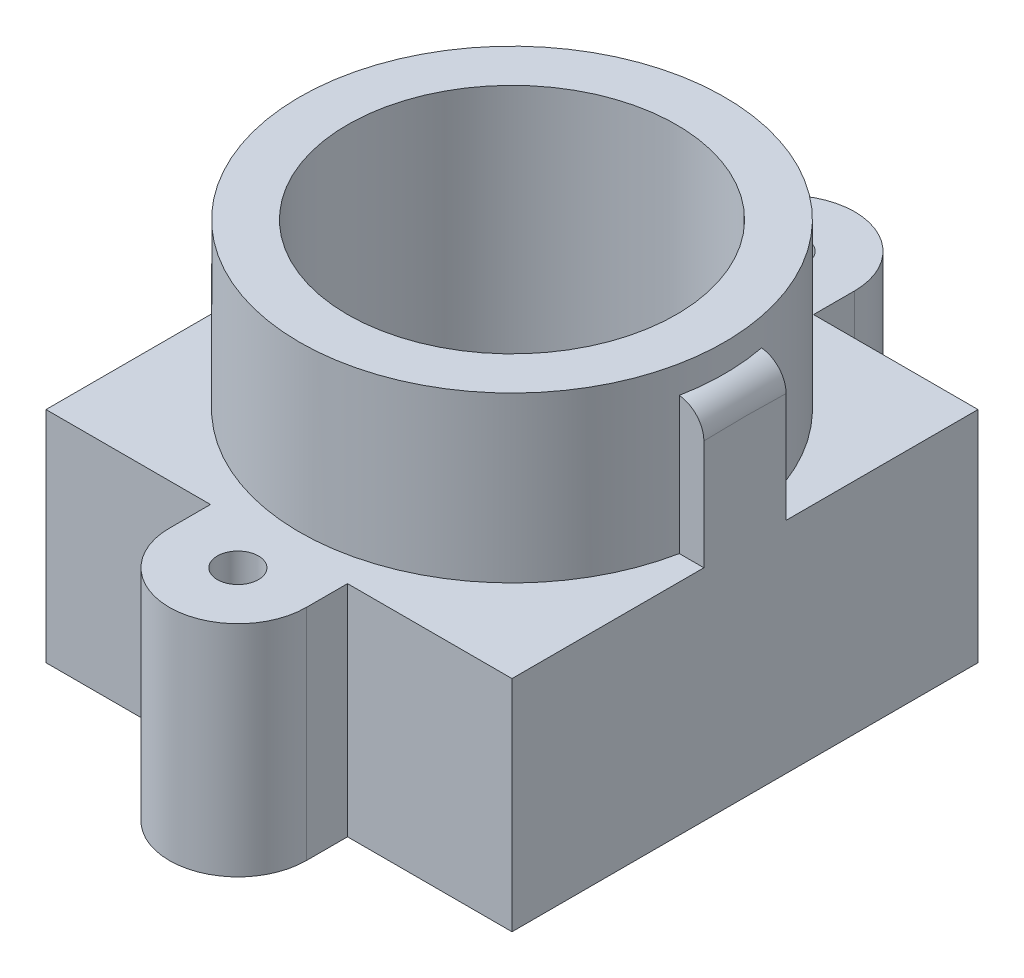
ISO-10303-21;
HEADER;
FILE_DESCRIPTION(('STEP AP214'),'2;1');
FILE_NAME('part.step','',(''),(''),'','','');
FILE_SCHEMA(('AUTOMOTIVE_DESIGN { 1 0 10303 214 1 1 1 1 }'));
ENDSEC;
DATA;
#1=APPLICATION_CONTEXT('core data for automotive mechanical design processes');
#2=APPLICATION_PROTOCOL_DEFINITION('international standard','automotive_design',2000,#1);
#3=PRODUCT_CONTEXT('',#1,'mechanical');
#4=PRODUCT('Part','Part','',(#3));
#5=PRODUCT_RELATED_PRODUCT_CATEGORY('part','',(#4));
#6=PRODUCT_DEFINITION_FORMATION('','',#4);
#7=PRODUCT_DEFINITION_CONTEXT('part definition',#1,'design');
#8=PRODUCT_DEFINITION('design','',#6,#7);
#9=PRODUCT_DEFINITION_SHAPE('','',#8);
#10=(LENGTH_UNIT() NAMED_UNIT(*) SI_UNIT(.MILLI.,.METRE.));
#11=(NAMED_UNIT(*) PLANE_ANGLE_UNIT() SI_UNIT($,.RADIAN.));
#12=(NAMED_UNIT(*) SI_UNIT($,.STERADIAN.) SOLID_ANGLE_UNIT());
#13=UNCERTAINTY_MEASURE_WITH_UNIT(LENGTH_MEASURE(1.E-05),#10,'distance_accuracy_value','');
#14=(GEOMETRIC_REPRESENTATION_CONTEXT(3) GLOBAL_UNCERTAINTY_ASSIGNED_CONTEXT((#13)) GLOBAL_UNIT_ASSIGNED_CONTEXT((#10,
#11,#12)) REPRESENTATION_CONTEXT('',''));
#15=CARTESIAN_POINT('',(0.,0.,0.));
#16=DIRECTION('',(0.,0.,1.));
#17=DIRECTION('',(1.,0.,0.));
#18=AXIS2_PLACEMENT_3D('',#15,#16,#17);
#19=CARTESIAN_POINT('',(0.,4.,-9.99999999999999));
#20=DIRECTION('',(0.,-1.,0.));
#21=DIRECTION('',(0.,0.,-1.));
#22=AXIS2_PLACEMENT_3D('',#19,#20,#21);
#23=PLANE('',#22);
#24=CARTESIAN_POINT('',(0.,4.,-9.99999999999999));
#25=DIRECTION('',(0.,1.,0.));
#26=DIRECTION('',(0.,0.,1.));
#27=AXIS2_PLACEMENT_3D('',#24,#25,#26);
#28=CIRCLE('',#27,0.75);
#29=CARTESIAN_POINT('',(0.,4.,-9.24999999999999));
#30=VERTEX_POINT('',#29);
#31=EDGE_CURVE('E192',#30,#30,#28,.T.);
#32=ORIENTED_EDGE('',*,*,#31,.F.);
#33=EDGE_LOOP('',(#32));
#34=FACE_BOUND('',#33,.T.);
#35=CARTESIAN_POINT('',(0.,4.,10.));
#36=DIRECTION('',(0.,1.,0.));
#37=DIRECTION('',(0.,0.,1.));
#38=AXIS2_PLACEMENT_3D('',#35,#36,#37);
#39=CIRCLE('',#38,0.75);
#40=CARTESIAN_POINT('',(0.,4.,10.75));
#41=VERTEX_POINT('',#40);
#42=EDGE_CURVE('E198',#41,#41,#39,.T.);
#43=ORIENTED_EDGE('',*,*,#42,.F.);
#44=EDGE_LOOP('',(#43));
#45=FACE_BOUND('',#44,.T.);
#46=DIRECTION('',(-1.,0.,0.));
#47=VECTOR('',#46,1.);
#48=CARTESIAN_POINT('',(8.5,4.,-1.5));
#49=LINE('',#48,#47);
#50=CARTESIAN_POINT('',(8.5,4.,-1.5));
#51=VERTEX_POINT('',#50);
#52=CARTESIAN_POINT('',(7.60345316287277,4.,-1.5));
#53=VERTEX_POINT('',#52);
#54=EDGE_CURVE('E176',#51,#53,#49,.T.);
#55=ORIENTED_EDGE('',*,*,#54,.F.);
#56=DIRECTION('',(0.,0.,-1.));
#57=VECTOR('',#56,1.);
#58=CARTESIAN_POINT('',(8.5,4.,-8.5));
#59=LINE('',#58,#57);
#60=CARTESIAN_POINT('',(8.5,4.,-8.5));
#61=VERTEX_POINT('',#60);
#62=EDGE_CURVE('E207',#51,#61,#59,.T.);
#63=ORIENTED_EDGE('',*,*,#62,.T.);
#64=DIRECTION('',(-1.,0.,0.));
#65=VECTOR('',#64,1.);
#66=CARTESIAN_POINT('',(2.5,4.,-8.5));
#67=LINE('',#66,#65);
#68=CARTESIAN_POINT('',(2.5,4.,-8.5));
#69=VERTEX_POINT('',#68);
#70=EDGE_CURVE('E212',#61,#69,#67,.T.);
#71=ORIENTED_EDGE('',*,*,#70,.T.);
#72=DIRECTION('',(0.,0.,-1.));
#73=VECTOR('',#72,1.);
#74=CARTESIAN_POINT('',(2.5,4.,-10.));
#75=LINE('',#74,#73);
#76=CARTESIAN_POINT('',(2.5,4.,-10.));
#77=VERTEX_POINT('',#76);
#78=EDGE_CURVE('E214',#69,#77,#75,.T.);
#79=ORIENTED_EDGE('',*,*,#78,.T.);
#80=CARTESIAN_POINT('',(0.,4.,-9.99999999999999));
#81=DIRECTION('',(0.,1.,0.));
#82=DIRECTION('',(0.,0.,-1.));
#83=AXIS2_PLACEMENT_3D('',#80,#81,#82);
#84=CIRCLE('',#83,2.5);
#85=CARTESIAN_POINT('',(-2.5,4.,-9.99999999999999));
#86=VERTEX_POINT('',#85);
#87=EDGE_CURVE('E216',#77,#86,#84,.T.);
#88=ORIENTED_EDGE('',*,*,#87,.T.);
#89=DIRECTION('',(0.,0.,1.));
#90=VECTOR('',#89,1.);
#91=CARTESIAN_POINT('',(-2.5,4.,-8.5));
#92=LINE('',#91,#90);
#93=CARTESIAN_POINT('',(-2.5,4.,-8.5));
#94=VERTEX_POINT('',#93);
#95=EDGE_CURVE('E218',#86,#94,#92,.T.);
#96=ORIENTED_EDGE('',*,*,#95,.T.);
#97=DIRECTION('',(-1.,0.,0.));
#98=VECTOR('',#97,1.);
#99=CARTESIAN_POINT('',(-8.5,4.,-8.5));
#100=LINE('',#99,#98);
#101=CARTESIAN_POINT('',(-8.5,4.,-8.5));
#102=VERTEX_POINT('',#101);
#103=EDGE_CURVE('E220',#94,#102,#100,.T.);
#104=ORIENTED_EDGE('',*,*,#103,.T.);
#105=DIRECTION('',(0.,0.,1.));
#106=VECTOR('',#105,1.);
#107=CARTESIAN_POINT('',(-8.5,4.,-8.5));
#108=LINE('',#107,#106);
#109=CARTESIAN_POINT('',(-8.5,4.,8.5));
#110=VERTEX_POINT('',#109);
#111=EDGE_CURVE('E222',#102,#110,#108,.T.);
#112=ORIENTED_EDGE('',*,*,#111,.T.);
#113=DIRECTION('',(1.,0.,0.));
#114=VECTOR('',#113,1.);
#115=CARTESIAN_POINT('',(-8.5,4.,8.5));
#116=LINE('',#115,#114);
#117=CARTESIAN_POINT('',(-2.5,4.,8.5));
#118=VERTEX_POINT('',#117);
#119=EDGE_CURVE('E224',#110,#118,#116,.T.);
#120=ORIENTED_EDGE('',*,*,#119,.T.);
#121=DIRECTION('',(0.,0.,1.));
#122=VECTOR('',#121,1.);
#123=CARTESIAN_POINT('',(-2.5,4.,8.5));
#124=LINE('',#123,#122);
#125=CARTESIAN_POINT('',(-2.49999999999999,4.,10.));
#126=VERTEX_POINT('',#125);
#127=EDGE_CURVE('E226',#118,#126,#124,.T.);
#128=ORIENTED_EDGE('',*,*,#127,.T.);
#129=CARTESIAN_POINT('',(0.,4.,10.));
#130=DIRECTION('',(0.,1.,0.));
#131=DIRECTION('',(0.,0.,-1.));
#132=AXIS2_PLACEMENT_3D('',#129,#130,#131);
#133=CIRCLE('',#132,2.5);
#134=CARTESIAN_POINT('',(2.5,4.,10.));
#135=VERTEX_POINT('',#134);
#136=EDGE_CURVE('E228',#126,#135,#133,.T.);
#137=ORIENTED_EDGE('',*,*,#136,.T.);
#138=DIRECTION('',(0.,0.,-1.));
#139=VECTOR('',#138,1.);
#140=CARTESIAN_POINT('',(2.5,4.,10.));
#141=LINE('',#140,#139);
#142=CARTESIAN_POINT('',(2.5,4.,8.5));
#143=VERTEX_POINT('',#142);
#144=EDGE_CURVE('E230',#135,#143,#141,.T.);
#145=ORIENTED_EDGE('',*,*,#144,.T.);
#146=DIRECTION('',(1.,0.,0.));
#147=VECTOR('',#146,1.);
#148=CARTESIAN_POINT('',(2.5,4.,8.5));
#149=LINE('',#148,#147);
#150=CARTESIAN_POINT('',(8.5,4.,8.5));
#151=VERTEX_POINT('',#150);
#152=EDGE_CURVE('E204',#143,#151,#149,.T.);
#153=ORIENTED_EDGE('',*,*,#152,.T.);
#154=CARTESIAN_POINT('',(8.5,4.,1.5));
#155=VERTEX_POINT('',#154);
#156=EDGE_CURVE('E209',#151,#155,#59,.T.);
#157=ORIENTED_EDGE('',*,*,#156,.T.);
#158=DIRECTION('',(1.,0.,0.));
#159=VECTOR('',#158,1.);
#160=CARTESIAN_POINT('',(8.5,4.,1.5));
#161=LINE('',#160,#159);
#162=CARTESIAN_POINT('',(7.60345316287277,4.,1.5));
#163=VERTEX_POINT('',#162);
#164=EDGE_CURVE('E173',#163,#155,#161,.T.);
#165=ORIENTED_EDGE('',*,*,#164,.F.);
#166=CARTESIAN_POINT('',(0.,4.,0.));
#167=DIRECTION('',(0.,1.,0.));
#168=DIRECTION('',(0.,0.,1.));
#169=AXIS2_PLACEMENT_3D('',#166,#167,#168);
#170=CIRCLE('',#169,7.75);
#171=EDGE_CURVE('E168',#53,#163,#170,.T.);
#172=ORIENTED_EDGE('',*,*,#171,.F.);
#173=EDGE_LOOP('',(#55,#63,#71,#79,#88,#96,#104,#112,#120,#128,#137,#145,#153,#157,#165,#172));
#174=FACE_BOUND('',#173,.T.);
#175=ADVANCED_FACE('F38',(#34,#45,#174),#23,.F.);
#176=CARTESIAN_POINT('',(0.,10.,0.));
#177=DIRECTION('',(0.,-1.,0.));
#178=DIRECTION('',(0.,0.,-1.));
#179=AXIS2_PLACEMENT_3D('',#176,#177,#178);
#180=CYLINDRICAL_SURFACE('',#179,7.75);
#181=CARTESIAN_POINT('',(0.,10.,0.));
#182=DIRECTION('',(0.,1.,0.));
#183=DIRECTION('',(0.,0.,1.));
#184=AXIS2_PLACEMENT_3D('',#181,#182,#183);
#185=CIRCLE('',#184,7.75);
#186=CARTESIAN_POINT('',(0.,10.,7.75));
#187=VERTEX_POINT('',#186);
#188=EDGE_CURVE('E186',#187,#187,#185,.T.);
#189=ORIENTED_EDGE('',*,*,#188,.F.);
#190=EDGE_LOOP('',(#189));
#191=FACE_BOUND('',#190,.T.);
#192=DIRECTION('',(0.,-1.,0.));
#193=VECTOR('',#192,1.);
#194=CARTESIAN_POINT('',(7.60345316287277,9.,-1.5));
#195=LINE('',#194,#193);
#196=CARTESIAN_POINT('',(7.60345316287277,9.,-1.5));
#197=VERTEX_POINT('',#196);
#198=EDGE_CURVE('E169',#197,#53,#195,.T.);
#199=ORIENTED_EDGE('',*,*,#198,.T.);
#200=ORIENTED_EDGE('',*,*,#171,.T.);
#201=DIRECTION('',(0.,-1.,0.));
#202=VECTOR('',#201,1.);
#203=CARTESIAN_POINT('',(7.60345316287277,9.,1.5));
#204=LINE('',#203,#202);
#205=CARTESIAN_POINT('',(7.60345316287277,9.,1.5));
#206=VERTEX_POINT('',#205);
#207=EDGE_CURVE('E158',#206,#163,#204,.T.);
#208=ORIENTED_EDGE('',*,*,#207,.F.);
#209=CARTESIAN_POINT('',(0.,9.,0.));
#210=DIRECTION('',(0.,-1.,0.));
#211=DIRECTION('',(0.,0.,-1.));
#212=AXIS2_PLACEMENT_3D('',#209,#210,#211);
#213=CIRCLE('',#212,7.75);
#214=EDGE_CURVE('E166',#197,#206,#213,.T.);
#215=ORIENTED_EDGE('',*,*,#214,.F.);
#216=EDGE_LOOP('',(#199,#200,#208,#215));
#217=FACE_BOUND('',#216,.T.);
#218=ADVANCED_FACE('F165',(#191,#217),#180,.T.);
#219=CARTESIAN_POINT('',(0.,-4.,-9.99999999999999));
#220=DIRECTION('',(0.,-1.,0.));
#221=DIRECTION('',(0.,0.,-1.));
#222=AXIS2_PLACEMENT_3D('',#219,#220,#221);
#223=PLANE('',#222);
#224=CARTESIAN_POINT('',(0.,-4.,0.));
#225=DIRECTION('',(0.,1.,0.));
#226=DIRECTION('',(0.,0.,1.));
#227=AXIS2_PLACEMENT_3D('',#224,#225,#226);
#228=CIRCLE('',#227,6.);
#229=CARTESIAN_POINT('',(0.,-4.,6.));
#230=VERTEX_POINT('',#229);
#231=EDGE_CURVE('E180',#230,#230,#228,.T.);
#232=ORIENTED_EDGE('',*,*,#231,.T.);
#233=EDGE_LOOP('',(#232));
#234=FACE_BOUND('',#233,.T.);
#235=CARTESIAN_POINT('',(0.,-4.,10.));
#236=DIRECTION('',(0.,1.,0.));
#237=DIRECTION('',(0.,0.,1.));
#238=AXIS2_PLACEMENT_3D('',#235,#236,#237);
#239=CIRCLE('',#238,0.75);
#240=CARTESIAN_POINT('',(0.,-4.,10.75));
#241=VERTEX_POINT('',#240);
#242=EDGE_CURVE('E195',#241,#241,#239,.T.);
#243=ORIENTED_EDGE('',*,*,#242,.T.);
#244=EDGE_LOOP('',(#243));
#245=FACE_BOUND('',#244,.T.);
#246=DIRECTION('',(1.,0.,0.));
#247=VECTOR('',#246,1.);
#248=CARTESIAN_POINT('',(2.5,-4.,8.5));
#249=LINE('',#248,#247);
#250=CARTESIAN_POINT('',(2.5,-4.,8.5));
#251=VERTEX_POINT('',#250);
#252=CARTESIAN_POINT('',(8.5,-4.,8.5));
#253=VERTEX_POINT('',#252);
#254=EDGE_CURVE('E201',#251,#253,#249,.T.);
#255=ORIENTED_EDGE('',*,*,#254,.F.);
#256=DIRECTION('',(0.,0.,-1.));
#257=VECTOR('',#256,1.);
#258=CARTESIAN_POINT('',(2.5,-4.,10.));
#259=LINE('',#258,#257);
#260=CARTESIAN_POINT('',(2.5,-4.,10.));
#261=VERTEX_POINT('',#260);
#262=EDGE_CURVE('E208',#261,#251,#259,.T.);
#263=ORIENTED_EDGE('',*,*,#262,.F.);
#264=CARTESIAN_POINT('',(0.,-4.,10.));
#265=DIRECTION('',(0.,1.,0.));
#266=DIRECTION('',(0.,0.,-1.));
#267=AXIS2_PLACEMENT_3D('',#264,#265,#266);
#268=CIRCLE('',#267,2.5);
#269=CARTESIAN_POINT('',(-2.49999999999999,-4.,10.));
#270=VERTEX_POINT('',#269);
#271=EDGE_CURVE('E253',#270,#261,#268,.T.);
#272=ORIENTED_EDGE('',*,*,#271,.F.);
#273=DIRECTION('',(0.,0.,1.));
#274=VECTOR('',#273,1.);
#275=CARTESIAN_POINT('',(-2.5,-4.,8.5));
#276=LINE('',#275,#274);
#277=CARTESIAN_POINT('',(-2.5,-4.,8.5));
#278=VERTEX_POINT('',#277);
#279=EDGE_CURVE('E251',#278,#270,#276,.T.);
#280=ORIENTED_EDGE('',*,*,#279,.F.);
#281=DIRECTION('',(1.,0.,0.));
#282=VECTOR('',#281,1.);
#283=CARTESIAN_POINT('',(-8.5,-4.,8.5));
#284=LINE('',#283,#282);
#285=CARTESIAN_POINT('',(-8.5,-4.,8.5));
#286=VERTEX_POINT('',#285);
#287=EDGE_CURVE('E249',#286,#278,#284,.T.);
#288=ORIENTED_EDGE('',*,*,#287,.F.);
#289=DIRECTION('',(0.,0.,1.));
#290=VECTOR('',#289,1.);
#291=CARTESIAN_POINT('',(-8.5,-4.,-8.5));
#292=LINE('',#291,#290);
#293=CARTESIAN_POINT('',(-8.5,-4.,-8.5));
#294=VERTEX_POINT('',#293);
#295=EDGE_CURVE('E247',#294,#286,#292,.T.);
#296=ORIENTED_EDGE('',*,*,#295,.F.);
#297=DIRECTION('',(-1.,0.,0.));
#298=VECTOR('',#297,1.);
#299=CARTESIAN_POINT('',(-8.5,-4.,-8.5));
#300=LINE('',#299,#298);
#301=CARTESIAN_POINT('',(-2.5,-4.,-8.5));
#302=VERTEX_POINT('',#301);
#303=EDGE_CURVE('E245',#302,#294,#300,.T.);
#304=ORIENTED_EDGE('',*,*,#303,.F.);
#305=DIRECTION('',(0.,0.,1.));
#306=VECTOR('',#305,1.);
#307=CARTESIAN_POINT('',(-2.5,-4.,-8.5));
#308=LINE('',#307,#306);
#309=CARTESIAN_POINT('',(-2.5,-4.,-9.99999999999999));
#310=VERTEX_POINT('',#309);
#311=EDGE_CURVE('E243',#310,#302,#308,.T.);
#312=ORIENTED_EDGE('',*,*,#311,.F.);
#313=CARTESIAN_POINT('',(0.,-4.,-9.99999999999999));
#314=DIRECTION('',(0.,1.,0.));
#315=DIRECTION('',(0.,0.,-1.));
#316=AXIS2_PLACEMENT_3D('',#313,#314,#315);
#317=CIRCLE('',#316,2.5);
#318=CARTESIAN_POINT('',(2.5,-4.,-10.));
#319=VERTEX_POINT('',#318);
#320=EDGE_CURVE('E241',#319,#310,#317,.T.);
#321=ORIENTED_EDGE('',*,*,#320,.F.);
#322=DIRECTION('',(0.,0.,-1.));
#323=VECTOR('',#322,1.);
#324=CARTESIAN_POINT('',(2.5,-4.,-10.));
#325=LINE('',#324,#323);
#326=CARTESIAN_POINT('',(2.5,-4.,-8.5));
#327=VERTEX_POINT('',#326);
#328=EDGE_CURVE('E239',#327,#319,#325,.T.);
#329=ORIENTED_EDGE('',*,*,#328,.F.);
#330=DIRECTION('',(-1.,0.,0.));
#331=VECTOR('',#330,1.);
#332=CARTESIAN_POINT('',(2.5,-4.,-8.5));
#333=LINE('',#332,#331);
#334=CARTESIAN_POINT('',(8.5,-4.,-8.5));
#335=VERTEX_POINT('',#334);
#336=EDGE_CURVE('E237',#335,#327,#333,.T.);
#337=ORIENTED_EDGE('',*,*,#336,.F.);
#338=DIRECTION('',(0.,0.,-1.));
#339=VECTOR('',#338,1.);
#340=CARTESIAN_POINT('',(8.5,-4.,-8.5));
#341=LINE('',#340,#339);
#342=EDGE_CURVE('E235',#253,#335,#341,.T.);
#343=ORIENTED_EDGE('',*,*,#342,.F.);
#344=EDGE_LOOP('',(#255,#263,#272,#280,#288,#296,#304,#312,#321,#329,#337,#343));
#345=FACE_BOUND('',#344,.T.);
#346=CARTESIAN_POINT('',(0.,-4.,-9.99999999999999));
#347=DIRECTION('',(0.,1.,0.));
#348=DIRECTION('',(0.,0.,1.));
#349=AXIS2_PLACEMENT_3D('',#346,#347,#348);
#350=CIRCLE('',#349,0.75);
#351=CARTESIAN_POINT('',(0.,-4.,-9.24999999999999));
#352=VERTEX_POINT('',#351);
#353=EDGE_CURVE('E189',#352,#352,#350,.T.);
#354=ORIENTED_EDGE('',*,*,#353,.T.);
#355=EDGE_LOOP('',(#354));
#356=FACE_BOUND('',#355,.T.);
#357=ADVANCED_FACE('F320',(#234,#245,#345,#356),#223,.T.);
#358=CARTESIAN_POINT('',(2.5,4.,8.5));
#359=DIRECTION('',(0.,0.,-1.));
#360=DIRECTION('',(-1.,0.,0.));
#361=AXIS2_PLACEMENT_3D('',#358,#359,#360);
#362=PLANE('',#361);
#363=ORIENTED_EDGE('',*,*,#254,.T.);
#364=DIRECTION('',(0.,-1.,0.));
#365=VECTOR('',#364,1.);
#366=CARTESIAN_POINT('',(8.5,4.,8.5));
#367=LINE('',#366,#365);
#368=EDGE_CURVE('E191',#151,#253,#367,.T.);
#369=ORIENTED_EDGE('',*,*,#368,.F.);
#370=ORIENTED_EDGE('',*,*,#152,.F.);
#371=DIRECTION('',(0.,-1.,0.));
#372=VECTOR('',#371,1.);
#373=CARTESIAN_POINT('',(2.5,4.,8.5));
#374=LINE('',#373,#372);
#375=EDGE_CURVE('E232',#143,#251,#374,.T.);
#376=ORIENTED_EDGE('',*,*,#375,.T.);
#377=EDGE_LOOP('',(#363,#369,#370,#376));
#378=FACE_BOUND('',#377,.T.);
#379=ADVANCED_FACE('F351',(#378),#362,.F.);
#380=CARTESIAN_POINT('',(8.5,4.,-8.5));
#381=DIRECTION('',(-1.,0.,0.));
#382=DIRECTION('',(0.,0.,1.));
#383=AXIS2_PLACEMENT_3D('',#380,#381,#382);
#384=PLANE('',#383);
#385=DIRECTION('',(0.,-1.,0.));
#386=VECTOR('',#385,1.);
#387=CARTESIAN_POINT('',(8.5,9.,-1.5));
#388=LINE('',#387,#386);
#389=CARTESIAN_POINT('',(8.5,8.00516147489543,-1.5));
#390=VERTEX_POINT('',#389);
#391=EDGE_CURVE('E172',#390,#51,#388,.T.);
#392=ORIENTED_EDGE('',*,*,#391,.F.);
#393=CARTESIAN_POINT('',(8.5,8.12900753604996,3.41598681712714));
#394=CARTESIAN_POINT('',(8.5,8.67186428334657,3.28906536051167));
#395=CARTESIAN_POINT('',(8.02578286472488,8.95728905907542,3.22233223345733));
#396=CARTESIAN_POINT('',(7.55156572944976,9.24271383480426,3.155599106403));
#397=CARTESIAN_POINT('',(7.05289524167659,9.,3.2123462935891));
#398=CARTESIAN_POINT('',(8.5,8.11202995168119,3.34321043014791));
#399=CARTESIAN_POINT('',(8.5,8.64848717256714,3.2304926931332));
#400=CARTESIAN_POINT('',(8.03805250584905,8.93708695302162,3.16932688647499));
#401=CARTESIAN_POINT('',(7.57601142018477,9.22584005320872,3.10860576010512));
#402=CARTESIAN_POINT('',(7.07871192072245,9.,3.15567480219715));
#403=CARTESIAN_POINT('',(8.5,8.09737416845856,3.26994137912006));
#404=CARTESIAN_POINT('',(8.5,8.62698321090475,3.16935040837538));
#405=CARTESIAN_POINT('',(8.04979615674002,8.91813434421962,3.11357730508466));
#406=CARTESIAN_POINT('',(7.59951220518523,9.2094114820711,3.058228442637));
#407=CARTESIAN_POINT('',(7.10430178846817,9.,3.0976698512828));
#408=CARTESIAN_POINT('',(8.5,8.07197541175776,3.12279501456098));
#409=CARTESIAN_POINT('',(8.5,8.58763750280736,3.04355893502601));
#410=CARTESIAN_POINT('',(8.07227903829466,8.8827016229234,2.99773524602691));
#411=CARTESIAN_POINT('',(7.6444762821307,9.17789489308511,2.95232160658249));
#412=CARTESIAN_POINT('',(7.15475095665814,9.,2.97928784577796));
#413=CARTESIAN_POINT('',(8.5,8.06122862506985,3.04891836608787));
#414=CARTESIAN_POINT('',(8.5,8.56975239687688,2.97889459639616));
#415=CARTESIAN_POINT('',(8.083019240175,8.86621911014227,2.93764706960851));
#416=CARTESIAN_POINT('',(7.66597169653367,9.16278507044608,2.89679718325518));
#417=CARTESIAN_POINT('',(7.17961094720846,9.,2.91891316690553));
#418=CARTESIAN_POINT('',(8.5,8.04291815255959,2.90104378743487));
#419=CARTESIAN_POINT('',(8.5,8.537329411782,2.84725762700923));
#420=CARTESIAN_POINT('',(8.10353139588954,8.83571302763454,2.8143767422862));
#421=CARTESIAN_POINT('',(7.70699753231783,9.13419377307724,2.78189171110351));
#422=CARTESIAN_POINT('',(7.22829146067519,9.,2.79618510157248));
#423=CARTESIAN_POINT('',(8.5,8.03534369871901,2.82704713764339));
#424=CARTESIAN_POINT('',(8.5,8.52274936732794,2.78026913362788));
#425=CARTESIAN_POINT('',(8.11330653767189,8.82168123544099,2.75120588405791));
#426=CARTESIAN_POINT('',(7.72655912471709,9.12068804519045,2.72251481002969));
#427=CARTESIAN_POINT('',(7.25211524989868,9.,2.73383919423626));
#428=CARTESIAN_POINT('',(8.5,8.02275664339733,2.67882077996783));
#429=CARTESIAN_POINT('',(8.5,8.49644951946934,2.64438095587848));
#430=CARTESIAN_POINT('',(8.13198148137445,8.79581711594236,2.622239986462));
#431=CARTESIAN_POINT('',(7.76390944775001,9.09525860798489,2.60046897815774));
#432=CARTESIAN_POINT('',(7.29862700050847,9.,2.60712513473131));
#433=CARTESIAN_POINT('',(8.5,8.01774474312136,2.60459101387958));
#434=CARTESIAN_POINT('',(8.5,8.48470635504747,2.57545155936326));
#435=CARTESIAN_POINT('',(8.14088104316764,8.78398539121639,2.55644423413451));
#436=CARTESIAN_POINT('',(7.78171887460392,9.0833187635084,2.53778195153238));
#437=CARTESIAN_POINT('',(7.32131464947634,9.,2.54275643416398));
#438=CARTESIAN_POINT('',(8.5,8.00582770060737,2.38233492309515));
#439=CARTESIAN_POINT('',(8.5,8.45335783032626,2.3676233842774));
#440=CARTESIAN_POINT('',(8.16625915827654,8.7515680709076,2.35648427877319));
#441=CARTESIAN_POINT('',(7.83234508168881,9.05000129977448,2.34670110132257));
#442=CARTESIAN_POINT('',(7.38722855638928,9.,2.34737778024676));
#443=CARTESIAN_POINT('',(8.5,8.00197656101815,2.23414987381316));
#444=CARTESIAN_POINT('',(8.5,8.43724344311405,2.22590915740622));
#445=CARTESIAN_POINT('',(8.18149824762862,8.73394193421186,2.21924632932443));
#446=CARTESIAN_POINT('',(7.86288474312951,9.03076036225965,2.21371756121936));
#447=CARTESIAN_POINT('',(7.42850280899294,9.,2.21360314122728));
#448=CARTESIAN_POINT('',(8.5,7.99922522362999,1.93763874960217));
#449=CARTESIAN_POINT('',(8.5,8.41208430809615,1.9391575167459));
#450=CARTESIAN_POINT('',(8.20890165197337,8.70483058970788,1.93918278019439));
#451=CARTESIAN_POINT('',(7.91769355931142,8.997692244775,1.94033762947893));
#452=CARTESIAN_POINT('',(7.50470907335066,9.,1.93961042299994));
#453=CARTESIAN_POINT('',(8.5,8.00032972854904,1.78931267431823));
#454=CARTESIAN_POINT('',(8.5,8.40296530038649,1.7938682964913));
#455=CARTESIAN_POINT('',(8.22106303477638,8.6933512265188,1.79635200056384));
#456=CARTESIAN_POINT('',(7.94205978221769,8.9837949449625,1.79973125402012));
#457=CARTESIAN_POINT('',(7.53963502810298,9.,1.79938634843891));
#458=CARTESIAN_POINT('',(8.5,8.00476350740443,1.50429673130222));
#459=CARTESIAN_POINT('',(8.5,8.38994343920701,1.51265916755722));
#460=CARTESIAN_POINT('',(8.24158727951952,8.67564013963304,1.51817752151606));
#461=CARTESIAN_POINT('',(7.98311895757295,8.96138427922722,1.52445210057279));
#462=CARTESIAN_POINT('',(7.59971016472843,9.,1.52482149236366));
#463=CARTESIAN_POINT('',(8.5,8.00791215787213,1.36760344220341));
#464=CARTESIAN_POINT('',(8.5,8.38565816151113,1.37675696605057));
#465=CARTESIAN_POINT('',(8.25017273073319,8.66906840481343,1.38312110953591));
#466=CARTESIAN_POINT('',(8.00031461686019,8.95250070319793,1.39005615494086));
#467=CARTESIAN_POINT('',(7.62541011561712,9.,1.39087742003837));
#468=CARTESIAN_POINT('',(8.5,8.01461204810146,1.09427058676493));
#469=CARTESIAN_POINT('',(8.5,8.37952936111073,1.10389320957955));
#470=CARTESIAN_POINT('',(8.26487293141781,8.65868101223824,1.11074963973354));
#471=CARTESIAN_POINT('',(8.02971522970134,8.93785405058373,1.11817425058274));
#472=CARTESIAN_POINT('',(7.66995324276636,9.,1.11947310097501));
#473=CARTESIAN_POINT('',(8.5,8.01816316396419,0.957631016816113));
#474=CARTESIAN_POINT('',(8.5,8.3776705678595,0.966742530840722));
#475=CARTESIAN_POINT('',(8.27098843862916,8.65486450893712,0.973435288086441));
#476=CARTESIAN_POINT('',(8.0419633830716,8.93206661739184,0.98050894404145));
#477=CARTESIAN_POINT('',(7.68879852175695,9.,0.982013946390959));
#478=CARTESIAN_POINT('',(8.5,8.02440021839108,0.68417387477816));
#479=CARTESIAN_POINT('',(8.5,8.37520437837181,0.691645724373129));
#480=CARTESIAN_POINT('',(8.28077835524387,8.64912335085021,0.697146429883694));
#481=CARTESIAN_POINT('',(8.06154322020278,8.92304998102356,0.70302778657873));
#482=CARTESIAN_POINT('',(7.7191816607295,9.,0.704445869654649));
#483=CARTESIAN_POINT('',(8.5,8.0270851666751,0.547356277246034));
#484=CARTESIAN_POINT('',(8.5,8.37459324241911,0.55350925940899));
#485=CARTESIAN_POINT('',(8.28444997563885,8.64720085634531,0.558170210187881));
#486=CARTESIAN_POINT('',(8.06889648601241,8.91981036390271,0.563022126971623));
#487=CARTESIAN_POINT('',(7.73071117112417,9.,0.564334107113601));
#488=CARTESIAN_POINT('',(8.5,8.03076403539148,0.273692542635655));
#489=CARTESIAN_POINT('',(8.5,8.37386976046429,0.277009952821028));
#490=CARTESIAN_POINT('',(8.28934553758108,8.6447037116333,0.27946283164328));
#491=CARTESIAN_POINT('',(8.07868783417246,8.91553919008952,0.282106527238713));
#492=CARTESIAN_POINT('',(7.7461211463173,9.,0.282814886875272));
#493=CARTESIAN_POINT('',(8.5,8.03175791195361,0.136846404909109));
#494=CARTESIAN_POINT('',(8.5,8.37375624896818,0.138457913980218));
#495=CARTESIAN_POINT('',(8.29056941562848,8.64412909639309,0.139731653303483));
#496=CARTESIAN_POINT('',(8.08113922597662,8.91450174168464,0.141005273270631));
#497=CARTESIAN_POINT('',(7.7500014126774,9.,0.141407395659519));
#498=CARTESIAN_POINT('',(8.5,8.03174959909032,-0.16663066509109));
#499=CARTESIAN_POINT('',(8.5,8.37374877017357,-0.168592904611741));
#500=CARTESIAN_POINT('',(8.29056941432809,8.64412355837507,-0.170143880211511));
#501=CARTESIAN_POINT('',(8.08113834802684,8.91449859270409,-0.171694689764425));
#502=CARTESIAN_POINT('',(7.74999827985708,9.,-0.172184343484842));
#503=CARTESIAN_POINT('',(8.5,8.03026589084321,-0.333261726324448));
#504=CARTESIAN_POINT('',(8.5,8.37390798250982,-0.337357357133493));
#505=CARTESIAN_POINT('',(8.28875481145422,8.64496877699532,-0.340288464635101));
#506=CARTESIAN_POINT('',(8.07750208587611,8.91603319688692,-0.343563899530996));
#507=CARTESIAN_POINT('',(7.74424132960318,9.,-0.344368545291774));
#508=CARTESIAN_POINT('',(8.5,8.02495328218399,-0.666492412110832));
#509=CARTESIAN_POINT('',(8.5,8.37511036501564,-0.673811645548338));
#510=CARTESIAN_POINT('',(8.28149573212453,8.64876665385138,-0.679232042834131));
#511=CARTESIAN_POINT('',(8.06298424220382,8.92242703975197,-0.684997264983675));
#512=CARTESIAN_POINT('',(7.72144544005339,9.,-0.686423744763367));
#513=CARTESIAN_POINT('',(8.5,8.02112420591883,-0.833092033369482));
#514=CARTESIAN_POINT('',(8.5,8.37615663190674,-0.84184290350271));
#515=CARTESIAN_POINT('',(8.27605098348177,8.65171947011523,-0.848030934749592));
#516=CARTESIAN_POINT('',(8.05207251565544,8.92729983730381,-0.854905328098912));
#517=CARTESIAN_POINT('',(7.70440565477554,9.,-0.856294567997133));
#518=CARTESIAN_POINT('',(8.5,8.0128966501838,-1.1663880620804));
#519=CARTESIAN_POINT('',(8.5,8.38076250347143,-1.17617020699692));
#520=CARTESIAN_POINT('',(8.26151274395691,8.6609340107132,-1.18301490533866));
#521=CARTESIAN_POINT('',(8.02299519066002,8.94112586390754,-1.19054990549832));
#522=CARTESIAN_POINT('',(7.65969656045913,9.,-1.19171986903435));
#523=CARTESIAN_POINT('',(8.5,8.00849778908662,-1.33308445917734));
#524=CARTESIAN_POINT('',(8.5,8.384339005924,-1.34280729091373));
#525=CARTESIAN_POINT('',(8.2524167989484,8.66719796150262,-1.34919814769043));
#526=CARTESIAN_POINT('',(8.00476432785643,8.95011316088884,-1.35661712047032));
#527=CARTESIAN_POINT('',(7.63202010258828,9.,-1.35727136376352));
#528=CARTESIAN_POINT('',(8.5,8.00349932380209,-1.58315755009853));
#529=CARTESIAN_POINT('',(8.5,8.39343236506221,-1.59024690881566));
#530=CARTESIAN_POINT('',(8.23598836328287,8.68043596099463,-1.59523503840254));
#531=CARTESIAN_POINT('',(7.97195978284419,8.96745299608282,-1.60048158923893));
#532=CARTESIAN_POINT('',(7.58329880071275,9.,-1.60092188366097));
#533=CARTESIAN_POINT('',(8.5,8.00209983829499,-1.66651556719419));
#534=CARTESIAN_POINT('',(8.5,8.39709992052928,-1.67256248910643));
#535=CARTESIAN_POINT('',(8.23004852119906,8.68548860259339,-1.6767034312108));
#536=CARTESIAN_POINT('',(7.96007288173214,8.97389990623862,-1.68114431635386));
#537=CARTESIAN_POINT('',(7.56585838213465,9.,-1.68135512116757));
#538=CARTESIAN_POINT('',(8.5,8.00026020820625,-1.83324787418982));
#539=CARTESIAN_POINT('',(8.5,8.40607339754812,-1.83635284117304));
#540=CARTESIAN_POINT('',(8.21722181510964,8.69715258651632,-1.83830929729636));
#541=CARTESIAN_POINT('',(7.9344200653182,8.98825255073955,-1.84056712995194));
#542=CARTESIAN_POINT('',(7.52873304430639,9.,-1.84047816134131));
#543=CARTESIAN_POINT('',(8.5,7.99982013849218,-1.91662216485203));
#544=CARTESIAN_POINT('',(8.5,8.41138813315973,-1.91787123205255));
#545=CARTESIAN_POINT('',(8.21033487724242,8.7037640504379,-1.9184466662236));
#546=CARTESIAN_POINT('',(7.92063964969379,8.99616795222767,-1.91936553713646));
#547=CARTESIAN_POINT('',(7.50904795002007,9.,-1.91916782747541));
#548=CARTESIAN_POINT('',(8.5,8.0000730546609,-2.));
#549=CARTESIAN_POINT('',(8.5,8.41770958488181,-1.99869919347167));
#550=CARTESIAN_POINT('',(8.20296542657148,8.71129362650038,-1.99778477145559));
#551=CARTESIAN_POINT('',(7.90593085314296,9.00487766811895,-1.99687034943951));
#552=CARTESIAN_POINT('',(7.48832078190964,9.,-1.99688554184265));
#553=(BOUNDED_SURFACE() B_SPLINE_SURFACE(3,2,((#393,#394,#395,#396,#397),(#398,#399,#400,#401,
#402),(#403,#404,#405,#406,#407),(#408,#409,#410,#411,#412),(#413,#414,#415,#416,#417),(#418,
#419,#420,#421,#422),(#423,#424,#425,#426,#427),(#428,#429,#430,#431,#432),(#433,#434,#435,#436,
#437),(#438,#439,#440,#441,#442),(#443,#444,#445,#446,#447),(#448,#449,#450,#451,#452),(#453,
#454,#455,#456,#457),(#458,#459,#460,#461,#462),(#463,#464,#465,#466,#467),(#468,#469,#470,#471,
#472),(#473,#474,#475,#476,#477),(#478,#479,#480,#481,#482),(#483,#484,#485,#486,#487),(#488,
#489,#490,#491,#492),(#493,#494,#495,#496,#497),(#498,#499,#500,#501,#502),(#503,#504,#505,#506,
#507),(#508,#509,#510,#511,#512),(#513,#514,#515,#516,#517),(#518,#519,#520,#521,#522),(#523,
#524,#525,#526,#527),(#528,#529,#530,#531,#532),(#533,#534,#535,#536,#537),(#538,#539,#540,#541,
#542),(#543,#544,#545,#546,#547),(#548,#549,#550,#551,#552)),.UNSPECIFIED.,.F.,.F.,
.F.) B_SPLINE_SURFACE_WITH_KNOTS((4,2,2,2,2,2,2,2,2,2,2,2,2,2,2,4),(3,2,3),(0.,0.22408501825102,
0.447950852518707,0.671050524827148,0.89421121245534,1.33874918836145,1.78370910305824,
2.19389315618711,2.60395127547086,3.01447656189477,3.42501249811528,3.92490050132335,
4.4248259901579,4.92508806462022,5.17519253002745,5.42531651152753),(0.,0.5,1.),
.UNSPECIFIED.) GEOMETRIC_REPRESENTATION_ITEM() RATIONAL_B_SPLINE_SURFACE(((1.,0.873436564589805,
1.,0.873436564589805,1.),(1.,0.876948061025352,1.,0.876948061025352,1.),(1.,0.8802886057975,1.,
0.8802886057975,1.),(1.,0.886650893646457,1.,0.886650893646457,1.),(1.,0.889672945356328,1.,
0.889672945356328,1.),(1.,0.895418267018469,1.,0.895418267018469,1.),(1.,0.898142524129055,1.,
0.898142524129055,1.),(1.,0.903325771190434,1.,0.903325771190434,1.),(1.,0.905784688389796,1.,
0.905784688389796,1.),(1.,0.912771252717621,1.,0.912771252717621,1.),(1.,0.91693132429264,1.,
0.91693132429264,1.),(1.,0.924372534233935,1.,0.924372534233935,1.),(1.,0.927652834601893,1.,
0.927652834601893,1.),(1.,0.933166976547417,1.,0.933166976547417,1.),(1.,0.935462567391146,1.,
0.935462567391146,1.),(1.,0.939382936151777,1.,0.939382936151777,1.),(1.,0.94100791980387,1.,
0.94100791980387,1.),(1.,0.943605248427865,1.,0.943605248427865,1.),(1.,0.94457684775861,1.,
0.94457684775861,1.),(1.,0.945871647498318,1.,0.945871647498318,1.),(1.,0.94619483108594,1.,
0.94619483108594,1.),(1.,0.946194888680511,1.,0.946194888680511,1.),(1.,0.945715785778075,1.,
0.945715785778075,1.),(1.,0.943794876688761,1.,0.943794876688761,1.),(1.,0.942352998313335,1.,
0.942352998313335,1.),(1.,0.938488230368017,1.,0.938488230368017,1.),(1.,0.936064680964754,1.,
0.936064680964754,1.),(1.,0.931663187864389,1.,0.931663187864389,1.),(1.,0.930068433731936,1.,
0.930068433731936,1.),(1.,0.926614182199287,1.,0.926614182199287,1.),(1.,0.924754664150417,1.,
0.924754664150417,1.),(1.,0.92275820954665,1.,0.92275820954665,1.))) REPRESENTATION_ITEM('') SURFACE());
#554=CARTESIAN_POINT('',(8.5,8.0000730546609,-2.));
#555=CARTESIAN_POINT('',(8.5,7.99982013849218,-1.91662216485203));
#556=CARTESIAN_POINT('',(8.5,8.00026020820625,-1.83324787418982));
#557=CARTESIAN_POINT('',(8.5,8.00209983829499,-1.66651556719419));
#558=CARTESIAN_POINT('',(8.5,8.00349932380209,-1.58315755009853));
#559=CARTESIAN_POINT('',(8.5,8.00849778908662,-1.33308445917734));
#560=CARTESIAN_POINT('',(8.5,8.0128966501838,-1.1663880620804));
#561=CARTESIAN_POINT('',(8.5,8.02112420591883,-0.833092033369483));
#562=CARTESIAN_POINT('',(8.5,8.02495328218399,-0.666492412110832));
#563=CARTESIAN_POINT('',(8.5,8.03026589084321,-0.333261726324448));
#564=CARTESIAN_POINT('',(8.5,8.03174959909032,-0.16663066509109));
#565=CARTESIAN_POINT('',(8.5,8.03175791195361,0.136846404909109));
#566=CARTESIAN_POINT('',(8.5,8.03076403539149,0.273692542635655));
#567=CARTESIAN_POINT('',(8.5,8.0270851666751,0.547356277246034));
#568=CARTESIAN_POINT('',(8.5,8.02440021839108,0.68417387477816));
#569=CARTESIAN_POINT('',(8.5,8.01816316396419,0.957631016816113));
#570=CARTESIAN_POINT('',(8.5,8.01461204810146,1.09427058676493));
#571=CARTESIAN_POINT('',(8.5,8.00791215787213,1.36760344220341));
#572=CARTESIAN_POINT('',(8.5,8.00476350740443,1.50429673130222));
#573=CARTESIAN_POINT('',(8.5,8.00032972854904,1.78931267431823));
#574=CARTESIAN_POINT('',(8.5,7.99922522362999,1.93763874960217));
#575=CARTESIAN_POINT('',(8.5,8.00197656101815,2.23414987381316));
#576=CARTESIAN_POINT('',(8.5,8.00582770060737,2.38233492309515));
#577=CARTESIAN_POINT('',(8.5,8.01774474312136,2.60459101387958));
#578=CARTESIAN_POINT('',(8.5,8.02275664339733,2.67882077996783));
#579=CARTESIAN_POINT('',(8.5,8.03534369871902,2.82704713764339));
#580=CARTESIAN_POINT('',(8.5,8.04291815255959,2.90104378743487));
#581=CARTESIAN_POINT('',(8.5,8.06122862506985,3.04891836608787));
#582=CARTESIAN_POINT('',(8.5,8.07197541175776,3.12279501456098));
#583=CARTESIAN_POINT('',(8.5,8.09737416845856,3.26994137912006));
#584=CARTESIAN_POINT('',(8.5,8.11202995168119,3.34321043014791));
#585=CARTESIAN_POINT('',(8.5,8.12900753604996,3.41598681712714));
#586=B_SPLINE_CURVE_WITH_KNOTS('',3,(#554,#555,#556,#557,#558,#559,#560,#561,#562,#563,#564,
#565,#566,#567,#568,#569,#570,#571,#572,#573,#574,#575,#576,#577,#578,#579,#580,#581,#582,#583,
#584,#585),.UNSPECIFIED.,.F.,.F.,(4,2,2,2,2,2,2,2,2,2,2,2,2,2,2,4),(0.,0.250123981500086,
0.500228446907312,1.00049052136963,1.50041601020419,2.00030401341225,2.41083994963276,
2.82136523605668,3.23142335534042,3.64160740846929,4.08656732316608,4.53110529907219,
4.75426598670039,4.97736565900883,5.20123149327651,5.42531651152753),.UNSPECIFIED.);
#587=CARTESIAN_POINT('',(8.5,8.00516147489543,1.5));
#588=VERTEX_POINT('',#587);
#589=EDGE_CURVE('E51',#390,#588,#586,.T.);
#590=ORIENTED_EDGE('',*,*,#589,.T.);
#591=DIRECTION('',(0.,-1.,0.));
#592=VECTOR('',#591,1.);
#593=CARTESIAN_POINT('',(8.5,9.,1.5));
#594=LINE('',#593,#592);
#595=EDGE_CURVE('E159',#588,#155,#594,.T.);
#596=ORIENTED_EDGE('',*,*,#595,.T.);
#597=ORIENTED_EDGE('',*,*,#156,.F.);
#598=ORIENTED_EDGE('',*,*,#368,.T.);
#599=ORIENTED_EDGE('',*,*,#342,.T.);
#600=DIRECTION('',(0.,-1.,0.));
#601=VECTOR('',#600,1.);
#602=CARTESIAN_POINT('',(8.5,4.,-8.5));
#603=LINE('',#602,#601);
#604=EDGE_CURVE('E285',#61,#335,#603,.T.);
#605=ORIENTED_EDGE('',*,*,#604,.F.);
#606=ORIENTED_EDGE('',*,*,#62,.F.);
#607=EDGE_LOOP('',(#392,#590,#596,#597,#598,#599,#605,#606));
#608=FACE_BOUND('',#607,.T.);
#609=ADVANCED_FACE('F391',(#608),#384,.F.);
#610=CARTESIAN_POINT('',(2.5,4.,-8.5));
#611=DIRECTION('',(0.,0.,1.));
#612=DIRECTION('',(1.,0.,0.));
#613=AXIS2_PLACEMENT_3D('',#610,#611,#612);
#614=PLANE('',#613);
#615=ORIENTED_EDGE('',*,*,#336,.T.);
#616=DIRECTION('',(0.,-1.,0.));
#617=VECTOR('',#616,1.);
#618=CARTESIAN_POINT('',(2.5,4.,-8.5));
#619=LINE('',#618,#617);
#620=EDGE_CURVE('E282',#69,#327,#619,.T.);
#621=ORIENTED_EDGE('',*,*,#620,.F.);
#622=ORIENTED_EDGE('',*,*,#70,.F.);
#623=ORIENTED_EDGE('',*,*,#604,.T.);
#624=EDGE_LOOP('',(#615,#621,#622,#623));
#625=FACE_BOUND('',#624,.T.);
#626=ADVANCED_FACE('F388',(#625),#614,.F.);
#627=CARTESIAN_POINT('',(2.5,4.,-10.));
#628=DIRECTION('',(-1.,0.,0.));
#629=DIRECTION('',(0.,0.,1.));
#630=AXIS2_PLACEMENT_3D('',#627,#628,#629);
#631=PLANE('',#630);
#632=ORIENTED_EDGE('',*,*,#328,.T.);
#633=DIRECTION('',(0.,-1.,0.));
#634=VECTOR('',#633,1.);
#635=CARTESIAN_POINT('',(2.5,4.,-10.));
#636=LINE('',#635,#634);
#637=EDGE_CURVE('E279',#77,#319,#636,.T.);
#638=ORIENTED_EDGE('',*,*,#637,.F.);
#639=ORIENTED_EDGE('',*,*,#78,.F.);
#640=ORIENTED_EDGE('',*,*,#620,.T.);
#641=EDGE_LOOP('',(#632,#638,#639,#640));
#642=FACE_BOUND('',#641,.T.);
#643=ADVANCED_FACE('F384',(#642),#631,.F.);
#644=CARTESIAN_POINT('',(0.,4.,-9.99999999999999));
#645=DIRECTION('',(0.,-1.,0.));
#646=DIRECTION('',(0.,0.,-1.));
#647=AXIS2_PLACEMENT_3D('',#644,#645,#646);
#648=CYLINDRICAL_SURFACE('',#647,2.5);
#649=ORIENTED_EDGE('',*,*,#320,.T.);
#650=DIRECTION('',(0.,-1.,0.));
#651=VECTOR('',#650,1.);
#652=CARTESIAN_POINT('',(-2.5,4.,-9.99999999999999));
#653=LINE('',#652,#651);
#654=EDGE_CURVE('E276',#86,#310,#653,.T.);
#655=ORIENTED_EDGE('',*,*,#654,.F.);
#656=ORIENTED_EDGE('',*,*,#87,.F.);
#657=ORIENTED_EDGE('',*,*,#637,.T.);
#658=EDGE_LOOP('',(#649,#655,#656,#657));
#659=FACE_BOUND('',#658,.T.);
#660=ADVANCED_FACE('F380',(#659),#648,.T.);
#661=CARTESIAN_POINT('',(-2.5,4.,-8.5));
#662=DIRECTION('',(1.,0.,0.));
#663=DIRECTION('',(0.,0.,-1.));
#664=AXIS2_PLACEMENT_3D('',#661,#662,#663);
#665=PLANE('',#664);
#666=ORIENTED_EDGE('',*,*,#311,.T.);
#667=DIRECTION('',(0.,-1.,0.));
#668=VECTOR('',#667,1.);
#669=CARTESIAN_POINT('',(-2.5,4.,-8.5));
#670=LINE('',#669,#668);
#671=EDGE_CURVE('E273',#94,#302,#670,.T.);
#672=ORIENTED_EDGE('',*,*,#671,.F.);
#673=ORIENTED_EDGE('',*,*,#95,.F.);
#674=ORIENTED_EDGE('',*,*,#654,.T.);
#675=EDGE_LOOP('',(#666,#672,#673,#674));
#676=FACE_BOUND('',#675,.T.);
#677=ADVANCED_FACE('F376',(#676),#665,.F.);
#678=CARTESIAN_POINT('',(-8.5,4.,-8.5));
#679=DIRECTION('',(0.,0.,1.));
#680=DIRECTION('',(1.,0.,0.));
#681=AXIS2_PLACEMENT_3D('',#678,#679,#680);
#682=PLANE('',#681);
#683=ORIENTED_EDGE('',*,*,#303,.T.);
#684=DIRECTION('',(0.,-1.,0.));
#685=VECTOR('',#684,1.);
#686=CARTESIAN_POINT('',(-8.5,4.,-8.5));
#687=LINE('',#686,#685);
#688=EDGE_CURVE('E270',#102,#294,#687,.T.);
#689=ORIENTED_EDGE('',*,*,#688,.F.);
#690=ORIENTED_EDGE('',*,*,#103,.F.);
#691=ORIENTED_EDGE('',*,*,#671,.T.);
#692=EDGE_LOOP('',(#683,#689,#690,#691));
#693=FACE_BOUND('',#692,.T.);
#694=ADVANCED_FACE('F372',(#693),#682,.F.);
#695=CARTESIAN_POINT('',(-8.5,4.,-8.5));
#696=DIRECTION('',(1.,0.,0.));
#697=DIRECTION('',(0.,0.,-1.));
#698=AXIS2_PLACEMENT_3D('',#695,#696,#697);
#699=PLANE('',#698);
#700=ORIENTED_EDGE('',*,*,#295,.T.);
#701=DIRECTION('',(0.,-1.,0.));
#702=VECTOR('',#701,1.);
#703=CARTESIAN_POINT('',(-8.5,4.,8.5));
#704=LINE('',#703,#702);
#705=EDGE_CURVE('E267',#110,#286,#704,.T.);
#706=ORIENTED_EDGE('',*,*,#705,.F.);
#707=ORIENTED_EDGE('',*,*,#111,.F.);
#708=ORIENTED_EDGE('',*,*,#688,.T.);
#709=EDGE_LOOP('',(#700,#706,#707,#708));
#710=FACE_BOUND('',#709,.T.);
#711=ADVANCED_FACE('F368',(#710),#699,.F.);
#712=CARTESIAN_POINT('',(-8.5,4.,8.5));
#713=DIRECTION('',(0.,0.,-1.));
#714=DIRECTION('',(-1.,0.,0.));
#715=AXIS2_PLACEMENT_3D('',#712,#713,#714);
#716=PLANE('',#715);
#717=ORIENTED_EDGE('',*,*,#287,.T.);
#718=DIRECTION('',(0.,-1.,0.));
#719=VECTOR('',#718,1.);
#720=CARTESIAN_POINT('',(-2.5,4.,8.5));
#721=LINE('',#720,#719);
#722=EDGE_CURVE('E264',#118,#278,#721,.T.);
#723=ORIENTED_EDGE('',*,*,#722,.F.);
#724=ORIENTED_EDGE('',*,*,#119,.F.);
#725=ORIENTED_EDGE('',*,*,#705,.T.);
#726=EDGE_LOOP('',(#717,#723,#724,#725));
#727=FACE_BOUND('',#726,.T.);
#728=ADVANCED_FACE('F364',(#727),#716,.F.);
#729=CARTESIAN_POINT('',(-2.5,4.,8.5));
#730=DIRECTION('',(1.,0.,0.));
#731=DIRECTION('',(0.,0.,-1.));
#732=AXIS2_PLACEMENT_3D('',#729,#730,#731);
#733=PLANE('',#732);
#734=ORIENTED_EDGE('',*,*,#279,.T.);
#735=DIRECTION('',(0.,-1.,0.));
#736=VECTOR('',#735,1.);
#737=CARTESIAN_POINT('',(-2.49999999999999,4.,10.));
#738=LINE('',#737,#736);
#739=EDGE_CURVE('E261',#126,#270,#738,.T.);
#740=ORIENTED_EDGE('',*,*,#739,.F.);
#741=ORIENTED_EDGE('',*,*,#127,.F.);
#742=ORIENTED_EDGE('',*,*,#722,.T.);
#743=EDGE_LOOP('',(#734,#740,#741,#742));
#744=FACE_BOUND('',#743,.T.);
#745=ADVANCED_FACE('F360',(#744),#733,.F.);
#746=CARTESIAN_POINT('',(0.,4.,10.));
#747=DIRECTION('',(0.,-1.,0.));
#748=DIRECTION('',(0.,0.,-1.));
#749=AXIS2_PLACEMENT_3D('',#746,#747,#748);
#750=CYLINDRICAL_SURFACE('',#749,2.5);
#751=ORIENTED_EDGE('',*,*,#271,.T.);
#752=DIRECTION('',(0.,-1.,0.));
#753=VECTOR('',#752,1.);
#754=CARTESIAN_POINT('',(2.5,4.,10.));
#755=LINE('',#754,#753);
#756=EDGE_CURVE('E258',#135,#261,#755,.T.);
#757=ORIENTED_EDGE('',*,*,#756,.F.);
#758=ORIENTED_EDGE('',*,*,#136,.F.);
#759=ORIENTED_EDGE('',*,*,#739,.T.);
#760=EDGE_LOOP('',(#751,#757,#758,#759));
#761=FACE_BOUND('',#760,.T.);
#762=ADVANCED_FACE('F356',(#761),#750,.T.);
#763=CARTESIAN_POINT('',(2.5,4.,10.));
#764=DIRECTION('',(-1.,0.,0.));
#765=DIRECTION('',(0.,0.,1.));
#766=AXIS2_PLACEMENT_3D('',#763,#764,#765);
#767=PLANE('',#766);
#768=ORIENTED_EDGE('',*,*,#262,.T.);
#769=ORIENTED_EDGE('',*,*,#375,.F.);
#770=ORIENTED_EDGE('',*,*,#144,.F.);
#771=ORIENTED_EDGE('',*,*,#756,.T.);
#772=EDGE_LOOP('',(#768,#769,#770,#771));
#773=FACE_BOUND('',#772,.T.);
#774=ADVANCED_FACE('F353',(#773),#767,.F.);
#775=CARTESIAN_POINT('',(0.,4.,10.));
#776=DIRECTION('',(0.,-1.,0.));
#777=DIRECTION('',(0.,0.,-1.));
#778=AXIS2_PLACEMENT_3D('',#775,#776,#777);
#779=CYLINDRICAL_SURFACE('',#778,0.75);
#780=ORIENTED_EDGE('',*,*,#42,.T.);
#781=EDGE_LOOP('',(#780));
#782=FACE_BOUND('',#781,.T.);
#783=ORIENTED_EDGE('',*,*,#242,.F.);
#784=EDGE_LOOP('',(#783));
#785=FACE_BOUND('',#784,.T.);
#786=ADVANCED_FACE('F348',(#782,#785),#779,.F.);
#787=CARTESIAN_POINT('',(0.,4.,-9.99999999999999));
#788=DIRECTION('',(0.,-1.,0.));
#789=DIRECTION('',(0.,0.,-1.));
#790=AXIS2_PLACEMENT_3D('',#787,#788,#789);
#791=CYLINDRICAL_SURFACE('',#790,0.75);
#792=ORIENTED_EDGE('',*,*,#31,.T.);
#793=EDGE_LOOP('',(#792));
#794=FACE_BOUND('',#793,.T.);
#795=ORIENTED_EDGE('',*,*,#353,.F.);
#796=EDGE_LOOP('',(#795));
#797=FACE_BOUND('',#796,.T.);
#798=ADVANCED_FACE('F315',(#794,#797),#791,.F.);
#799=CARTESIAN_POINT('',(0.,10.,0.));
#800=DIRECTION('',(0.,1.,0.));
#801=DIRECTION('',(0.,0.,1.));
#802=AXIS2_PLACEMENT_3D('',#799,#800,#801);
#803=PLANE('',#802);
#804=CARTESIAN_POINT('',(0.,10.,0.));
#805=DIRECTION('',(0.,1.,0.));
#806=DIRECTION('',(0.,0.,1.));
#807=AXIS2_PLACEMENT_3D('',#804,#805,#806);
#808=CIRCLE('',#807,6.);
#809=CARTESIAN_POINT('',(0.,10.,6.));
#810=VERTEX_POINT('',#809);
#811=EDGE_CURVE('E582',#810,#810,#808,.T.);
#812=ORIENTED_EDGE('',*,*,#811,.F.);
#813=EDGE_LOOP('',(#812));
#814=FACE_BOUND('',#813,.T.);
#815=ORIENTED_EDGE('',*,*,#188,.T.);
#816=EDGE_LOOP('',(#815));
#817=FACE_BOUND('',#816,.T.);
#818=ADVANCED_FACE('F310',(#814,#817),#803,.T.);
#819=CARTESIAN_POINT('',(8.5,9.,-1.5));
#820=DIRECTION('',(0.,0.,1.));
#821=DIRECTION('',(1.,0.,0.));
#822=AXIS2_PLACEMENT_3D('',#819,#820,#821);
#823=PLANE('',#822);
#824=ORIENTED_EDGE('',*,*,#198,.F.);
#825=CARTESIAN_POINT('',(7.60345316287277,9.,-1.5));
#826=CARTESIAN_POINT('',(7.6314328074738,8.99708871477846,-1.5));
#827=CARTESIAN_POINT('',(7.65927615699703,8.99299770874378,-1.5));
#828=CARTESIAN_POINT('',(7.71451825550071,8.9824863878596,-1.5));
#829=CARTESIAN_POINT('',(7.74191702537256,8.97606618279542,-1.5));
#830=CARTESIAN_POINT('',(7.82310577123996,8.95338059551137,-1.5));
#831=CARTESIAN_POINT('',(7.87597875917421,8.93368072680345,-1.5));
#832=CARTESIAN_POINT('',(7.97766530053227,8.88568396340326,-1.5));
#833=CARTESIAN_POINT('',(8.02647687059916,8.85738289941744,-1.5));
#834=CARTESIAN_POINT('',(8.1186522122837,8.79299362965353,-1.5));
#835=CARTESIAN_POINT('',(8.16201732989229,8.75690735386277,-1.5));
#836=CARTESIAN_POINT('',(8.24207469059768,8.67796904007115,-1.5));
#837=CARTESIAN_POINT('',(8.2787667924428,8.63511685888823,-1.5));
#838=CARTESIAN_POINT('',(8.34445478285861,8.54383993535761,-1.5));
#839=CARTESIAN_POINT('',(8.3734472727423,8.49541274561969,-1.5));
#840=CARTESIAN_POINT('',(8.42290854736084,8.39435246842047,-1.5));
#841=CARTESIAN_POINT('',(8.44337121251738,8.34171639352148,-1.5));
#842=CARTESIAN_POINT('',(8.47514109428252,8.23379589820349,-1.5));
#843=CARTESIAN_POINT('',(8.48646168029627,8.17851547076147,-1.5));
#844=CARTESIAN_POINT('',(8.49537792454266,8.10321944962229,-1.5));
#845=CARTESIAN_POINT('',(8.49711203495136,8.08363042148823,-1.5));
#846=CARTESIAN_POINT('',(8.49942155401857,8.04441752622688,-1.5));
#847=CARTESIAN_POINT('',(8.49999892522413,8.02479377474163,-1.5));
#848=CARTESIAN_POINT('',(8.5,8.00516147489543,-1.5));
#849=B_SPLINE_CURVE_WITH_KNOTS('',3,(#825,#826,#827,#828,#829,#830,#831,#832,#833,#834,#835,
#836,#837,#838,#839,#840,#841,#842,#843,#844,#845,#846,#847,#848),.UNSPECIFIED.,.F.,.F.,(4,2,2,
2,2,2,2,2,2,2,2,4),(0.,0.0843402478997206,0.168676520991293,0.337079322596263,0.505563885349765,
0.674006727956223,0.842453135677299,1.01097377423415,1.17961510784695,1.34800937095739,
1.40698083640516,1.46585216465947),.UNSPECIFIED.);
#850=EDGE_CURVE('E66',#197,#390,#849,.T.);
#851=ORIENTED_EDGE('',*,*,#850,.T.);
#852=ORIENTED_EDGE('',*,*,#391,.T.);
#853=ORIENTED_EDGE('',*,*,#54,.T.);
#854=EDGE_LOOP('',(#824,#851,#852,#853));
#855=FACE_BOUND('',#854,.T.);
#856=ADVANCED_FACE('F305',(#855),#823,.F.);
#857=CARTESIAN_POINT('',(8.5,9.,1.5));
#858=DIRECTION('',(0.,0.,-1.));
#859=DIRECTION('',(-1.,0.,0.));
#860=AXIS2_PLACEMENT_3D('',#857,#858,#859);
#861=PLANE('',#860);
#862=ORIENTED_EDGE('',*,*,#595,.F.);
#863=CARTESIAN_POINT('',(8.5,8.00516147489543,1.5));
#864=CARTESIAN_POINT('',(8.49999982543075,8.03330531247568,1.5));
#865=CARTESIAN_POINT('',(8.49881154440817,8.06143562728465,1.5));
#866=CARTESIAN_POINT('',(8.49407116643082,8.11749506409932,1.5));
#867=CARTESIAN_POINT('',(8.4905191762994,8.14542419513948,1.5));
#868=CARTESIAN_POINT('',(8.47635108155439,8.22856437488318,1.5));
#869=CARTESIAN_POINT('',(8.46222276183346,8.28321864053355,1.5));
#870=CARTESIAN_POINT('',(8.42498973078718,8.38937764343441,1.5));
#871=CARTESIAN_POINT('',(8.40188062543072,8.44088082465393,1.5));
#872=CARTESIAN_POINT('',(8.34734870381438,8.53927185647266,1.5));
#873=CARTESIAN_POINT('',(8.31592797960873,8.58616086440127,1.5));
#874=CARTESIAN_POINT('',(8.24566583652396,8.67398599892386,1.5));
#875=CARTESIAN_POINT('',(8.20682575865683,8.71492319892686,1.5));
#876=CARTESIAN_POINT('',(8.12280457175907,8.78971601923665,1.5));
#877=CARTESIAN_POINT('',(8.07762067885602,8.82356851421275,1.5));
#878=CARTESIAN_POINT('',(7.98220171824788,8.8832075993879,1.5));
#879=CARTESIAN_POINT('',(7.93196503152034,8.90899159331809,1.5));
#880=CARTESIAN_POINT('',(7.82791324447525,8.95172909777371,1.5));
#881=CARTESIAN_POINT('',(7.77410351814318,8.968695545519,1.5));
#882=CARTESIAN_POINT('',(7.70019715280088,8.98531479345171,1.5));
#883=CARTESIAN_POINT('',(7.68095362861876,8.98904894316117,1.5));
#884=CARTESIAN_POINT('',(7.6423133770482,8.99537644715829,1.5));
#885=CARTESIAN_POINT('',(7.62291696473828,8.99797172494412,1.5));
#886=CARTESIAN_POINT('',(7.60345316287277,9.,1.5));
#887=B_SPLINE_CURVE_WITH_KNOTS('',3,(#863,#864,#865,#866,#867,#868,#869,#870,#871,#872,#873,
#874,#875,#876,#877,#878,#879,#880,#881,#882,#883,#884,#885,#886),.UNSPECIFIED.,.F.,.F.,(4,2,2,
2,2,2,2,2,2,2,2,4),(0.,0.0843795813641213,0.168755349612421,0.33723904660389,0.505805281647144,
0.674329128473119,0.842822544207552,1.01139013279523,1.18001190713805,1.34838557391791,
1.4071678189872,1.46585039802141),.UNSPECIFIED.);
#888=EDGE_CURVE('E11',#588,#206,#887,.T.);
#889=ORIENTED_EDGE('',*,*,#888,.T.);
#890=ORIENTED_EDGE('',*,*,#207,.T.);
#891=ORIENTED_EDGE('',*,*,#164,.T.);
#892=EDGE_LOOP('',(#862,#889,#890,#891));
#893=FACE_BOUND('',#892,.T.);
#894=ADVANCED_FACE('F156',(#893),#861,.F.);
#895=ORIENTED_EDGE('',*,*,#888,.F.);
#896=ORIENTED_EDGE('',*,*,#589,.F.);
#897=ORIENTED_EDGE('',*,*,#850,.F.);
#898=ORIENTED_EDGE('',*,*,#214,.T.);
#899=EDGE_LOOP('',(#895,#896,#897,#898));
#900=FACE_BOUND('',#899,.T.);
#901=ADVANCED_FACE('F171',(#900),#553,.T.);
#902=CARTESIAN_POINT('',(0.,10.,0.));
#903=DIRECTION('',(0.,1.,0.));
#904=DIRECTION('',(0.,0.,1.));
#905=AXIS2_PLACEMENT_3D('',#902,#903,#904);
#906=CYLINDRICAL_SURFACE('',#905,6.);
#907=ORIENTED_EDGE('',*,*,#231,.F.);
#908=EDGE_LOOP('',(#907));
#909=FACE_BOUND('',#908,.T.);
#910=ORIENTED_EDGE('',*,*,#811,.T.);
#911=EDGE_LOOP('',(#910));
#912=FACE_BOUND('',#911,.T.);
#913=ADVANCED_FACE('F332',(#909,#912),#906,.F.);
#914=CLOSED_SHELL('',(#175,#218,#357,#379,#609,#626,#643,#660,#677,#694,#711,#728,#745,#762,
#774,#786,#798,#818,#856,#894,#901,#913));
#915=MANIFOLD_SOLID_BREP('B2',#914);
#916=ADVANCED_BREP_SHAPE_REPRESENTATION('',(#18,#915),#14);
#917=SHAPE_DEFINITION_REPRESENTATION(#9,#916);
ENDSEC;
END-ISO-10303-21;
